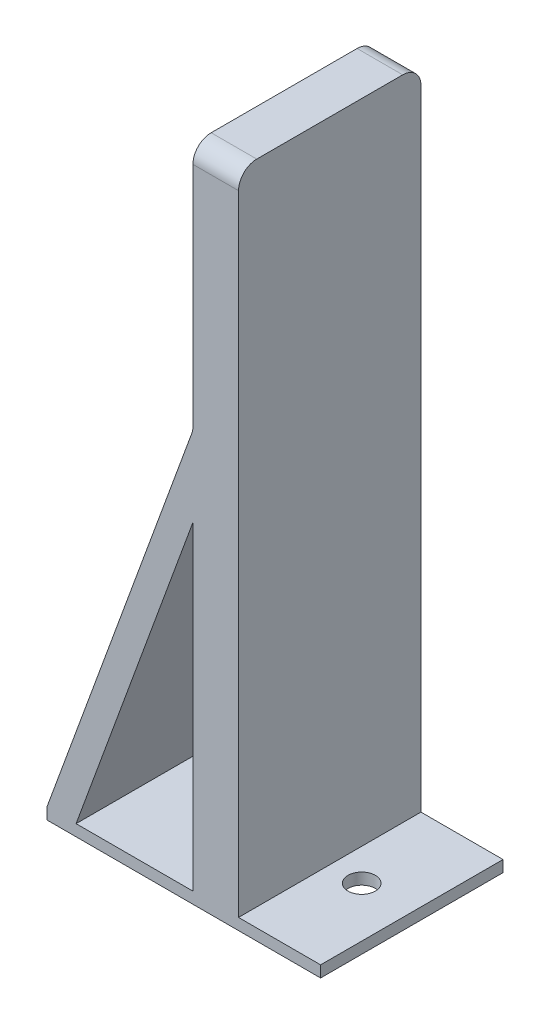
ISO-10303-21;
HEADER;
FILE_DESCRIPTION(('STEP AP214'),'2;1');
FILE_NAME('part.step','',(''),(''),'','','');
FILE_SCHEMA(('AUTOMOTIVE_DESIGN { 1 0 10303 214 1 1 1 1 }'));
ENDSEC;
DATA;
#1=APPLICATION_CONTEXT('core data for automotive mechanical design processes');
#2=APPLICATION_PROTOCOL_DEFINITION('international standard','automotive_design',2000,#1);
#3=PRODUCT_CONTEXT('',#1,'mechanical');
#4=PRODUCT('Part','Part','',(#3));
#5=PRODUCT_RELATED_PRODUCT_CATEGORY('part','',(#4));
#6=PRODUCT_DEFINITION_FORMATION('','',#4);
#7=PRODUCT_DEFINITION_CONTEXT('part definition',#1,'design');
#8=PRODUCT_DEFINITION('design','',#6,#7);
#9=PRODUCT_DEFINITION_SHAPE('','',#8);
#10=(LENGTH_UNIT() NAMED_UNIT(*) SI_UNIT(.MILLI.,.METRE.));
#11=(NAMED_UNIT(*) PLANE_ANGLE_UNIT() SI_UNIT($,.RADIAN.));
#12=(NAMED_UNIT(*) SI_UNIT($,.STERADIAN.) SOLID_ANGLE_UNIT());
#13=UNCERTAINTY_MEASURE_WITH_UNIT(LENGTH_MEASURE(1.E-05),#10,'distance_accuracy_value','');
#14=(GEOMETRIC_REPRESENTATION_CONTEXT(3) GLOBAL_UNCERTAINTY_ASSIGNED_CONTEXT((#13)) GLOBAL_UNIT_ASSIGNED_CONTEXT((#10,
#11,#12)) REPRESENTATION_CONTEXT('',''));
#15=CARTESIAN_POINT('',(0.,0.,0.));
#16=DIRECTION('',(0.,0.,1.));
#17=DIRECTION('',(1.,0.,0.));
#18=AXIS2_PLACEMENT_3D('',#15,#16,#17);
#19=CARTESIAN_POINT('',(1.,72.25,-10.));
#20=DIRECTION('',(1.,0.,0.));
#21=DIRECTION('',(0.,0.,-1.));
#22=AXIS2_PLACEMENT_3D('',#19,#20,#21);
#23=PLANE('',#22);
#24=DIRECTION('',(0.,-1.,0.));
#25=VECTOR('',#24,1.);
#26=CARTESIAN_POINT('',(1.,72.25,10.));
#27=LINE('',#26,#25);
#28=CARTESIAN_POINT('',(1.,36.25,10.));
#29=VERTEX_POINT('',#28);
#30=CARTESIAN_POINT('',(1.,1.25,10.));
#31=VERTEX_POINT('',#30);
#32=EDGE_CURVE('E146',#29,#31,#27,.T.);
#33=ORIENTED_EDGE('',*,*,#32,.F.);
#34=DIRECTION('',(0.,0.,1.));
#35=VECTOR('',#34,1.);
#36=CARTESIAN_POINT('',(1.,36.25,-56.5662468005848));
#37=LINE('',#36,#35);
#38=CARTESIAN_POINT('',(1.,36.25,-10.));
#39=VERTEX_POINT('',#38);
#40=EDGE_CURVE('E163',#39,#29,#37,.T.);
#41=ORIENTED_EDGE('',*,*,#40,.F.);
#42=DIRECTION('',(0.,-1.,0.));
#43=VECTOR('',#42,1.);
#44=CARTESIAN_POINT('',(1.,72.25,-10.));
#45=LINE('',#44,#43);
#46=CARTESIAN_POINT('',(1.,1.25,-10.));
#47=VERTEX_POINT('',#46);
#48=EDGE_CURVE('E208',#39,#47,#45,.T.);
#49=ORIENTED_EDGE('',*,*,#48,.T.);
#50=DIRECTION('',(0.,0.,1.));
#51=VECTOR('',#50,1.);
#52=CARTESIAN_POINT('',(1.,1.25,-10.));
#53=LINE('',#52,#51);
#54=EDGE_CURVE('E183',#47,#31,#53,.T.);
#55=ORIENTED_EDGE('',*,*,#54,.T.);
#56=EDGE_LOOP('',(#33,#41,#49,#55));
#57=FACE_BOUND('',#56,.T.);
#58=ADVANCED_FACE('F38',(#57),#23,.F.);
#59=CARTESIAN_POINT('',(0.,1.25,0.));
#60=DIRECTION('',(0.,-1.,0.));
#61=DIRECTION('',(0.,0.,-1.));
#62=AXIS2_PLACEMENT_3D('',#59,#60,#61);
#63=PLANE('',#62);
#64=CARTESIAN_POINT('',(9.5,1.25,0.));
#65=DIRECTION('',(0.,1.,0.));
#66=DIRECTION('',(0.,0.,1.));
#67=AXIS2_PLACEMENT_3D('',#64,#65,#66);
#68=CIRCLE('',#67,1.5);
#69=CARTESIAN_POINT('',(9.5,1.25,1.5));
#70=VERTEX_POINT('',#69);
#71=EDGE_CURVE('E172',#70,#70,#68,.T.);
#72=ORIENTED_EDGE('',*,*,#71,.F.);
#73=EDGE_LOOP('',(#72));
#74=FACE_BOUND('',#73,.T.);
#75=DIRECTION('',(0.,0.,-1.));
#76=VECTOR('',#75,1.);
#77=CARTESIAN_POINT('',(6.,1.25,10.));
#78=LINE('',#77,#76);
#79=CARTESIAN_POINT('',(6.,1.25,10.));
#80=VERTEX_POINT('',#79);
#81=CARTESIAN_POINT('',(6.,1.25,-10.));
#82=VERTEX_POINT('',#81);
#83=EDGE_CURVE('E189',#80,#82,#78,.T.);
#84=ORIENTED_EDGE('',*,*,#83,.F.);
#85=DIRECTION('',(1.,0.,0.));
#86=VECTOR('',#85,1.);
#87=CARTESIAN_POINT('',(-15.,1.25,10.));
#88=LINE('',#87,#86);
#89=CARTESIAN_POINT('',(15.,1.25,10.));
#90=VERTEX_POINT('',#89);
#91=EDGE_CURVE('E152',#80,#90,#88,.T.);
#92=ORIENTED_EDGE('',*,*,#91,.T.);
#93=DIRECTION('',(0.,0.,-1.));
#94=VECTOR('',#93,1.);
#95=CARTESIAN_POINT('',(15.,1.25,10.));
#96=LINE('',#95,#94);
#97=CARTESIAN_POINT('',(15.,1.25,-10.));
#98=VERTEX_POINT('',#97);
#99=EDGE_CURVE('E214',#90,#98,#96,.T.);
#100=ORIENTED_EDGE('',*,*,#99,.T.);
#101=DIRECTION('',(-1.,0.,0.));
#102=VECTOR('',#101,1.);
#103=CARTESIAN_POINT('',(-15.,1.25,-10.));
#104=LINE('',#103,#102);
#105=EDGE_CURVE('E219',#98,#82,#104,.T.);
#106=ORIENTED_EDGE('',*,*,#105,.T.);
#107=EDGE_LOOP('',(#84,#92,#100,#106));
#108=FACE_BOUND('',#107,.T.);
#109=ADVANCED_FACE('F311',(#74,#108),#63,.F.);
#110=CARTESIAN_POINT('',(-11.8055111187642,1.25,-10.));
#111=VERTEX_POINT('',#110);
#112=EDGE_CURVE('E158',#47,#111,#104,.T.);
#113=ORIENTED_EDGE('',*,*,#112,.T.);
#114=DIRECTION('',(0.,0.,1.));
#115=VECTOR('',#114,1.);
#116=CARTESIAN_POINT('',(-11.8055111187642,1.25,-56.5662468005848));
#117=LINE('',#116,#115);
#118=CARTESIAN_POINT('',(-11.8055111187642,1.25,10.));
#119=VERTEX_POINT('',#118);
#120=EDGE_CURVE('E155',#111,#119,#117,.T.);
#121=ORIENTED_EDGE('',*,*,#120,.T.);
#122=EDGE_CURVE('E140',#119,#31,#88,.T.);
#123=ORIENTED_EDGE('',*,*,#122,.T.);
#124=ORIENTED_EDGE('',*,*,#54,.F.);
#125=EDGE_LOOP('',(#113,#121,#123,#124));
#126=FACE_BOUND('',#125,.T.);
#127=ADVANCED_FACE('F156',(#126),#63,.F.);
#128=CARTESIAN_POINT('',(15.,1.25,10.));
#129=DIRECTION('',(-1.,0.,0.));
#130=DIRECTION('',(0.,0.,1.));
#131=AXIS2_PLACEMENT_3D('',#128,#129,#130);
#132=PLANE('',#131);
#133=DIRECTION('',(0.,0.,-1.));
#134=VECTOR('',#133,1.);
#135=CARTESIAN_POINT('',(15.,0.,10.));
#136=LINE('',#135,#134);
#137=CARTESIAN_POINT('',(15.,0.,10.));
#138=VERTEX_POINT('',#137);
#139=CARTESIAN_POINT('',(15.,0.,-10.));
#140=VERTEX_POINT('',#139);
#141=EDGE_CURVE('E213',#138,#140,#136,.T.);
#142=ORIENTED_EDGE('',*,*,#141,.T.);
#143=DIRECTION('',(0.,-1.,0.));
#144=VECTOR('',#143,1.);
#145=CARTESIAN_POINT('',(15.,1.25,-10.));
#146=LINE('',#145,#144);
#147=EDGE_CURVE('E249',#98,#140,#146,.T.);
#148=ORIENTED_EDGE('',*,*,#147,.F.);
#149=ORIENTED_EDGE('',*,*,#99,.F.);
#150=DIRECTION('',(0.,-1.,0.));
#151=VECTOR('',#150,1.);
#152=CARTESIAN_POINT('',(15.,1.25,10.));
#153=LINE('',#152,#151);
#154=EDGE_CURVE('E151',#90,#138,#153,.T.);
#155=ORIENTED_EDGE('',*,*,#154,.T.);
#156=EDGE_LOOP('',(#142,#148,#149,#155));
#157=FACE_BOUND('',#156,.T.);
#158=ADVANCED_FACE('F317',(#157),#132,.F.);
#159=CARTESIAN_POINT('',(-15.,1.25,-10.));
#160=DIRECTION('',(0.,0.,1.));
#161=DIRECTION('',(1.,0.,0.));
#162=AXIS2_PLACEMENT_3D('',#159,#160,#161);
#163=PLANE('',#162);
#164=CARTESIAN_POINT('',(1.,70.25,-10.));
#165=VERTEX_POINT('',#164);
#166=CARTESIAN_POINT('',(1.,45.3355557157941,-10.));
#167=VERTEX_POINT('',#166);
#168=EDGE_CURVE('E209',#165,#167,#45,.T.);
#169=ORIENTED_EDGE('',*,*,#168,.F.);
#170=DIRECTION('',(-1.,0.,0.));
#171=VECTOR('',#170,1.);
#172=CARTESIAN_POINT('',(6.,70.25,-10.));
#173=LINE('',#172,#171);
#174=CARTESIAN_POINT('',(6.,70.25,-10.));
#175=VERTEX_POINT('',#174);
#176=EDGE_CURVE('E62',#165,#175,#173,.F.);
#177=ORIENTED_EDGE('',*,*,#176,.T.);
#178=DIRECTION('',(0.,-1.,0.));
#179=VECTOR('',#178,1.);
#180=CARTESIAN_POINT('',(6.,72.25,-10.));
#181=LINE('',#180,#179);
#182=EDGE_CURVE('E193',#175,#82,#181,.T.);
#183=ORIENTED_EDGE('',*,*,#182,.T.);
#184=ORIENTED_EDGE('',*,*,#105,.F.);
#185=ORIENTED_EDGE('',*,*,#147,.T.);
#186=DIRECTION('',(-1.,0.,0.));
#187=VECTOR('',#186,1.);
#188=CARTESIAN_POINT('',(-15.,0.,-10.));
#189=LINE('',#188,#187);
#190=CARTESIAN_POINT('',(-15.,0.,-10.));
#191=VERTEX_POINT('',#190);
#192=EDGE_CURVE('E230',#140,#191,#189,.T.);
#193=ORIENTED_EDGE('',*,*,#192,.T.);
#194=DIRECTION('',(0.,-1.,0.));
#195=VECTOR('',#194,1.);
#196=CARTESIAN_POINT('',(-15.,1.25,-10.));
#197=LINE('',#196,#195);
#198=CARTESIAN_POINT('',(-15.,1.25,-10.));
#199=VERTEX_POINT('',#198);
#200=EDGE_CURVE('E245',#199,#191,#197,.T.);
#201=ORIENTED_EDGE('',*,*,#200,.F.);
#202=DIRECTION('',(0.343596512480775,0.939117371051696,0.));
#203=VECTOR('',#202,1.);
#204=CARTESIAN_POINT('',(-15.,1.25,-10.));
#205=LINE('',#204,#203);
#206=CARTESIAN_POINT('',(0.878234742103402,44.6483626908325,-10.));
#207=VERTEX_POINT('',#206);
#208=EDGE_CURVE('E179',#199,#207,#205,.T.);
#209=ORIENTED_EDGE('',*,*,#208,.T.);
#210=CARTESIAN_POINT('',(-0.999999999999998,45.3355557157941,-10.));
#211=DIRECTION('',(0.,0.,1.));
#212=DIRECTION('',(1.,0.,0.));
#213=AXIS2_PLACEMENT_3D('',#210,#211,#212);
#214=CIRCLE('',#213,2.);
#215=EDGE_CURVE('E11',#207,#167,#214,.T.);
#216=ORIENTED_EDGE('',*,*,#215,.T.);
#217=EDGE_LOOP('',(#169,#177,#183,#184,#185,#193,#201,#209,#216));
#218=FACE_BOUND('',#217,.T.);
#219=DIRECTION('',(-0.343596512480775,-0.939117371051696,0.));
#220=VECTOR('',#219,1.);
#221=CARTESIAN_POINT('',(1.,36.25,-10.));
#222=LINE('',#221,#220);
#223=EDGE_CURVE('E177',#39,#111,#222,.T.);
#224=ORIENTED_EDGE('',*,*,#223,.T.);
#225=ORIENTED_EDGE('',*,*,#112,.F.);
#226=ORIENTED_EDGE('',*,*,#48,.F.);
#227=EDGE_LOOP('',(#224,#225,#226));
#228=FACE_BOUND('',#227,.T.);
#229=ADVANCED_FACE('F296',(#218,#228),#163,.F.);
#230=CARTESIAN_POINT('',(-15.,1.25,10.));
#231=DIRECTION('',(1.,0.,0.));
#232=DIRECTION('',(0.,0.,-1.));
#233=AXIS2_PLACEMENT_3D('',#230,#231,#232);
#234=PLANE('',#233);
#235=DIRECTION('',(0.,0.,1.));
#236=VECTOR('',#235,1.);
#237=CARTESIAN_POINT('',(-15.,0.,10.));
#238=LINE('',#237,#236);
#239=CARTESIAN_POINT('',(-15.,0.,10.));
#240=VERTEX_POINT('',#239);
#241=EDGE_CURVE('E233',#191,#240,#238,.T.);
#242=ORIENTED_EDGE('',*,*,#241,.T.);
#243=DIRECTION('',(0.,-1.,0.));
#244=VECTOR('',#243,1.);
#245=CARTESIAN_POINT('',(-15.,1.25,10.));
#246=LINE('',#245,#244);
#247=CARTESIAN_POINT('',(-15.,1.25,10.));
#248=VERTEX_POINT('',#247);
#249=EDGE_CURVE('E241',#248,#240,#246,.T.);
#250=ORIENTED_EDGE('',*,*,#249,.F.);
#251=DIRECTION('',(0.,0.,1.));
#252=VECTOR('',#251,1.);
#253=CARTESIAN_POINT('',(-15.,1.25,10.));
#254=LINE('',#253,#252);
#255=EDGE_CURVE('E223',#199,#248,#254,.T.);
#256=ORIENTED_EDGE('',*,*,#255,.F.);
#257=ORIENTED_EDGE('',*,*,#200,.T.);
#258=EDGE_LOOP('',(#242,#250,#256,#257));
#259=FACE_BOUND('',#258,.T.);
#260=ADVANCED_FACE('F322',(#259),#234,.F.);
#261=CARTESIAN_POINT('',(-15.,1.25,10.));
#262=DIRECTION('',(0.,0.,-1.));
#263=DIRECTION('',(-1.,0.,0.));
#264=AXIS2_PLACEMENT_3D('',#261,#262,#263);
#265=PLANE('',#264);
#266=ORIENTED_EDGE('',*,*,#122,.F.);
#267=DIRECTION('',(0.343596512480775,0.939117371051696,0.));
#268=VECTOR('',#267,1.);
#269=CARTESIAN_POINT('',(1.,36.25,10.));
#270=LINE('',#269,#268);
#271=EDGE_CURVE('E145',#119,#29,#270,.T.);
#272=ORIENTED_EDGE('',*,*,#271,.T.);
#273=ORIENTED_EDGE('',*,*,#32,.T.);
#274=EDGE_LOOP('',(#266,#272,#273));
#275=FACE_BOUND('',#274,.T.);
#276=DIRECTION('',(0.,-1.,0.));
#277=VECTOR('',#276,1.);
#278=CARTESIAN_POINT('',(6.,72.25,10.));
#279=LINE('',#278,#277);
#280=CARTESIAN_POINT('',(6.,70.25,10.));
#281=VERTEX_POINT('',#280);
#282=EDGE_CURVE('E201',#281,#80,#279,.T.);
#283=ORIENTED_EDGE('',*,*,#282,.F.);
#284=DIRECTION('',(1.,0.,0.));
#285=VECTOR('',#284,1.);
#286=CARTESIAN_POINT('',(1.,70.25,10.));
#287=LINE('',#286,#285);
#288=CARTESIAN_POINT('',(1.,70.25,10.));
#289=VERTEX_POINT('',#288);
#290=EDGE_CURVE('E281',#281,#289,#287,.F.);
#291=ORIENTED_EDGE('',*,*,#290,.T.);
#292=CARTESIAN_POINT('',(1.,45.3355557157941,10.));
#293=VERTEX_POINT('',#292);
#294=EDGE_CURVE('E204',#289,#293,#27,.T.);
#295=ORIENTED_EDGE('',*,*,#294,.T.);
#296=CARTESIAN_POINT('',(-0.999999999999996,45.3355557157941,10.));
#297=DIRECTION('',(0.,0.,-1.));
#298=DIRECTION('',(-1.,0.,0.));
#299=AXIS2_PLACEMENT_3D('',#296,#297,#298);
#300=CIRCLE('',#299,2.);
#301=CARTESIAN_POINT('',(0.878234742103405,44.6483626908325,10.));
#302=VERTEX_POINT('',#301);
#303=EDGE_CURVE('E47',#293,#302,#300,.T.);
#304=ORIENTED_EDGE('',*,*,#303,.T.);
#305=DIRECTION('',(-0.343596512480775,-0.939117371051696,0.));
#306=VECTOR('',#305,1.);
#307=CARTESIAN_POINT('',(-15.,1.25,10.));
#308=LINE('',#307,#306);
#309=EDGE_CURVE('E169',#302,#248,#308,.T.);
#310=ORIENTED_EDGE('',*,*,#309,.T.);
#311=ORIENTED_EDGE('',*,*,#249,.T.);
#312=DIRECTION('',(1.,0.,0.));
#313=VECTOR('',#312,1.);
#314=CARTESIAN_POINT('',(-15.,0.,10.));
#315=LINE('',#314,#313);
#316=EDGE_CURVE('E218',#240,#138,#315,.T.);
#317=ORIENTED_EDGE('',*,*,#316,.T.);
#318=ORIENTED_EDGE('',*,*,#154,.F.);
#319=ORIENTED_EDGE('',*,*,#91,.F.);
#320=EDGE_LOOP('',(#283,#291,#295,#304,#310,#311,#317,#318,#319));
#321=FACE_BOUND('',#320,.T.);
#322=ADVANCED_FACE('F142',(#275,#321),#265,.F.);
#323=CARTESIAN_POINT('',(0.,0.,0.));
#324=DIRECTION('',(0.,-1.,0.));
#325=DIRECTION('',(0.,0.,-1.));
#326=AXIS2_PLACEMENT_3D('',#323,#324,#325);
#327=PLANE('',#326);
#328=CARTESIAN_POINT('',(9.5,0.,0.));
#329=DIRECTION('',(0.,-1.,0.));
#330=DIRECTION('',(0.,0.,-1.));
#331=AXIS2_PLACEMENT_3D('',#328,#329,#330);
#332=CIRCLE('',#331,1.5);
#333=CARTESIAN_POINT('',(9.5,0.,-1.5));
#334=VERTEX_POINT('',#333);
#335=EDGE_CURVE('E332',#334,#334,#332,.F.);
#336=ORIENTED_EDGE('',*,*,#335,.T.);
#337=EDGE_LOOP('',(#336));
#338=FACE_BOUND('',#337,.T.);
#339=ORIENTED_EDGE('',*,*,#141,.F.);
#340=ORIENTED_EDGE('',*,*,#316,.F.);
#341=ORIENTED_EDGE('',*,*,#241,.F.);
#342=ORIENTED_EDGE('',*,*,#192,.F.);
#343=EDGE_LOOP('',(#339,#340,#341,#342));
#344=FACE_BOUND('',#343,.T.);
#345=ADVANCED_FACE('F324',(#338,#344),#327,.T.);
#346=ORIENTED_EDGE('',*,*,#168,.T.);
#347=DIRECTION('',(0.,0.,1.));
#348=VECTOR('',#347,1.);
#349=CARTESIAN_POINT('',(1.,45.3355557157941,-9.99999999999999));
#350=LINE('',#349,#348);
#351=EDGE_CURVE('E259',#167,#293,#350,.T.);
#352=ORIENTED_EDGE('',*,*,#351,.T.);
#353=ORIENTED_EDGE('',*,*,#294,.F.);
#354=CARTESIAN_POINT('',(1.,70.25,8.));
#355=DIRECTION('',(1.,0.,0.));
#356=DIRECTION('',(0.,0.,-1.));
#357=AXIS2_PLACEMENT_3D('',#354,#355,#356);
#358=CIRCLE('',#357,2.);
#359=CARTESIAN_POINT('',(1.,72.25,8.));
#360=VERTEX_POINT('',#359);
#361=EDGE_CURVE('E253',#289,#360,#358,.F.);
#362=ORIENTED_EDGE('',*,*,#361,.T.);
#363=DIRECTION('',(0.,0.,1.));
#364=VECTOR('',#363,1.);
#365=CARTESIAN_POINT('',(1.,72.25,-10.));
#366=LINE('',#365,#364);
#367=CARTESIAN_POINT('',(1.,72.25,-8.));
#368=VERTEX_POINT('',#367);
#369=EDGE_CURVE('E184',#368,#360,#366,.T.);
#370=ORIENTED_EDGE('',*,*,#369,.F.);
#371=CARTESIAN_POINT('',(1.,70.25,-8.));
#372=DIRECTION('',(1.,0.,0.));
#373=DIRECTION('',(0.,0.,-1.));
#374=AXIS2_PLACEMENT_3D('',#371,#372,#373);
#375=CIRCLE('',#374,2.);
#376=EDGE_CURVE('E256',#368,#165,#375,.F.);
#377=ORIENTED_EDGE('',*,*,#376,.T.);
#378=EDGE_LOOP('',(#346,#352,#353,#362,#370,#377));
#379=FACE_BOUND('',#378,.T.);
#380=ADVANCED_FACE('F299',(#379),#23,.F.);
#381=CARTESIAN_POINT('',(6.,72.25,10.));
#382=DIRECTION('',(-1.,0.,0.));
#383=DIRECTION('',(0.,0.,1.));
#384=AXIS2_PLACEMENT_3D('',#381,#382,#383);
#385=PLANE('',#384);
#386=ORIENTED_EDGE('',*,*,#182,.F.);
#387=CARTESIAN_POINT('',(6.,70.25,-8.));
#388=DIRECTION('',(-1.,0.,0.));
#389=DIRECTION('',(0.,0.,1.));
#390=AXIS2_PLACEMENT_3D('',#387,#388,#389);
#391=CIRCLE('',#390,2.);
#392=CARTESIAN_POINT('',(6.,72.25,-8.));
#393=VERTEX_POINT('',#392);
#394=EDGE_CURVE('E278',#175,#393,#391,.F.);
#395=ORIENTED_EDGE('',*,*,#394,.T.);
#396=DIRECTION('',(0.,0.,-1.));
#397=VECTOR('',#396,1.);
#398=CARTESIAN_POINT('',(6.,72.25,10.));
#399=LINE('',#398,#397);
#400=CARTESIAN_POINT('',(6.,72.25,8.));
#401=VERTEX_POINT('',#400);
#402=EDGE_CURVE('E188',#401,#393,#399,.T.);
#403=ORIENTED_EDGE('',*,*,#402,.F.);
#404=CARTESIAN_POINT('',(6.,70.25,8.));
#405=DIRECTION('',(-1.,0.,0.));
#406=DIRECTION('',(0.,0.,1.));
#407=AXIS2_PLACEMENT_3D('',#404,#405,#406);
#408=CIRCLE('',#407,2.);
#409=EDGE_CURVE('E54',#401,#281,#408,.F.);
#410=ORIENTED_EDGE('',*,*,#409,.T.);
#411=ORIENTED_EDGE('',*,*,#282,.T.);
#412=ORIENTED_EDGE('',*,*,#83,.T.);
#413=EDGE_LOOP('',(#386,#395,#403,#410,#411,#412));
#414=FACE_BOUND('',#413,.T.);
#415=ADVANCED_FACE('F308',(#414),#385,.F.);
#416=CARTESIAN_POINT('',(0.,72.25,0.));
#417=DIRECTION('',(0.,1.,0.));
#418=DIRECTION('',(0.,0.,1.));
#419=AXIS2_PLACEMENT_3D('',#416,#417,#418);
#420=PLANE('',#419);
#421=ORIENTED_EDGE('',*,*,#402,.T.);
#422=DIRECTION('',(-1.,0.,0.));
#423=VECTOR('',#422,1.);
#424=CARTESIAN_POINT('',(1.,72.25,-8.));
#425=LINE('',#424,#423);
#426=EDGE_CURVE('E270',#393,#368,#425,.T.);
#427=ORIENTED_EDGE('',*,*,#426,.T.);
#428=ORIENTED_EDGE('',*,*,#369,.T.);
#429=DIRECTION('',(1.,0.,0.));
#430=VECTOR('',#429,1.);
#431=CARTESIAN_POINT('',(6.,72.25,8.));
#432=LINE('',#431,#430);
#433=EDGE_CURVE('E266',#360,#401,#432,.T.);
#434=ORIENTED_EDGE('',*,*,#433,.T.);
#435=EDGE_LOOP('',(#421,#427,#428,#434));
#436=FACE_BOUND('',#435,.T.);
#437=ADVANCED_FACE('F306',(#436),#420,.T.);
#438=CARTESIAN_POINT('',(1.,36.25,-56.5662468005848));
#439=DIRECTION('',(0.939117371051696,-0.343596512480775,0.));
#440=DIRECTION('',(0.343596512480775,0.939117371051696,0.));
#441=AXIS2_PLACEMENT_3D('',#438,#439,#440);
#442=PLANE('',#441);
#443=ORIENTED_EDGE('',*,*,#223,.F.);
#444=ORIENTED_EDGE('',*,*,#40,.T.);
#445=ORIENTED_EDGE('',*,*,#271,.F.);
#446=ORIENTED_EDGE('',*,*,#120,.F.);
#447=EDGE_LOOP('',(#443,#444,#445,#446));
#448=FACE_BOUND('',#447,.T.);
#449=ADVANCED_FACE('F166',(#448),#442,.T.);
#450=CARTESIAN_POINT('',(-15.,1.25,-56.5662468005848));
#451=DIRECTION('',(-0.939117371051696,0.343596512480775,0.));
#452=DIRECTION('',(-0.343596512480775,-0.939117371051696,0.));
#453=AXIS2_PLACEMENT_3D('',#450,#451,#452);
#454=PLANE('',#453);
#455=ORIENTED_EDGE('',*,*,#309,.F.);
#456=DIRECTION('',(0.,0.,1.));
#457=VECTOR('',#456,1.);
#458=CARTESIAN_POINT('',(0.878234742103388,44.6483626908325,-56.5662468005849));
#459=LINE('',#458,#457);
#460=EDGE_CURVE('E263',#302,#207,#459,.F.);
#461=ORIENTED_EDGE('',*,*,#460,.T.);
#462=ORIENTED_EDGE('',*,*,#208,.F.);
#463=ORIENTED_EDGE('',*,*,#255,.T.);
#464=EDGE_LOOP('',(#455,#461,#462,#463));
#465=FACE_BOUND('',#464,.T.);
#466=ADVANCED_FACE('F291',(#465),#454,.T.);
#467=CARTESIAN_POINT('',(9.5,-0.000999999999999916,0.));
#468=DIRECTION('',(0.,1.,0.));
#469=DIRECTION('',(0.,0.,1.));
#470=AXIS2_PLACEMENT_3D('',#467,#468,#469);
#471=CYLINDRICAL_SURFACE('',#470,1.5);
#472=ORIENTED_EDGE('',*,*,#335,.F.);
#473=EDGE_LOOP('',(#472));
#474=FACE_BOUND('',#473,.T.);
#475=ORIENTED_EDGE('',*,*,#71,.T.);
#476=EDGE_LOOP('',(#475));
#477=FACE_BOUND('',#476,.T.);
#478=ADVANCED_FACE('F340',(#474,#477),#471,.F.);
#479=CARTESIAN_POINT('',(-0.999999999999998,45.3355557157941,-9.99999999999999));
#480=DIRECTION('',(0.,0.,1.));
#481=DIRECTION('',(0.,-1.,0.));
#482=AXIS2_PLACEMENT_3D('',#479,#480,#481);
#483=CYLINDRICAL_SURFACE('',#482,2.);
#484=ORIENTED_EDGE('',*,*,#215,.F.);
#485=ORIENTED_EDGE('',*,*,#460,.F.);
#486=ORIENTED_EDGE('',*,*,#303,.F.);
#487=ORIENTED_EDGE('',*,*,#351,.F.);
#488=EDGE_LOOP('',(#484,#485,#486,#487));
#489=FACE_BOUND('',#488,.T.);
#490=ADVANCED_FACE('F295',(#489),#483,.F.);
#491=CARTESIAN_POINT('',(0.,70.25,-8.));
#492=DIRECTION('',(1.,0.,0.));
#493=DIRECTION('',(0.,0.,-1.));
#494=AXIS2_PLACEMENT_3D('',#491,#492,#493);
#495=CYLINDRICAL_SURFACE('',#494,2.);
#496=ORIENTED_EDGE('',*,*,#394,.F.);
#497=ORIENTED_EDGE('',*,*,#176,.F.);
#498=ORIENTED_EDGE('',*,*,#376,.F.);
#499=ORIENTED_EDGE('',*,*,#426,.F.);
#500=EDGE_LOOP('',(#496,#497,#498,#499));
#501=FACE_BOUND('',#500,.T.);
#502=ADVANCED_FACE('F304',(#501),#495,.T.);
#503=CARTESIAN_POINT('',(0.,70.25,8.));
#504=DIRECTION('',(-1.,0.,0.));
#505=DIRECTION('',(0.,0.,1.));
#506=AXIS2_PLACEMENT_3D('',#503,#504,#505);
#507=CYLINDRICAL_SURFACE('',#506,2.);
#508=ORIENTED_EDGE('',*,*,#361,.F.);
#509=ORIENTED_EDGE('',*,*,#290,.F.);
#510=ORIENTED_EDGE('',*,*,#409,.F.);
#511=ORIENTED_EDGE('',*,*,#433,.F.);
#512=EDGE_LOOP('',(#508,#509,#510,#511));
#513=FACE_BOUND('',#512,.T.);
#514=ADVANCED_FACE('F40',(#513),#507,.T.);
#515=CLOSED_SHELL('',(#58,#109,#127,#158,#229,#260,#322,#345,#380,#415,#437,#449,#466,#478,#490,
#502,#514));
#516=MANIFOLD_SOLID_BREP('B2',#515);
#517=ADVANCED_BREP_SHAPE_REPRESENTATION('',(#18,#516),#14);
#518=SHAPE_DEFINITION_REPRESENTATION(#9,#517);
ENDSEC;
END-ISO-10303-21;
